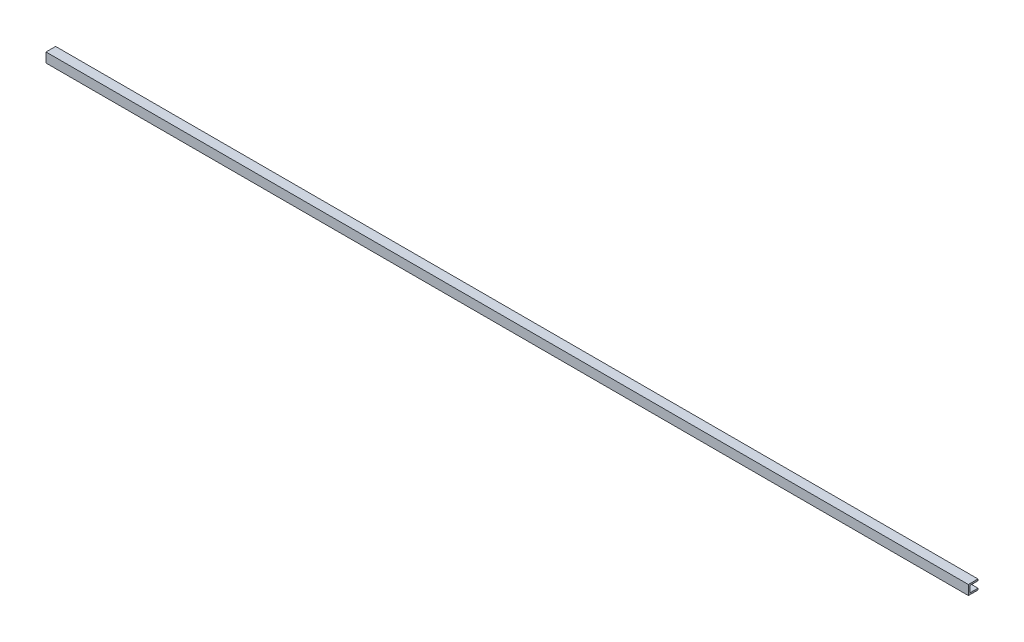
ISO-10303-21;
HEADER;
FILE_DESCRIPTION(('STEP AP214'),'2;1');
FILE_NAME('part.step','',(''),(''),'','','');
FILE_SCHEMA(('AUTOMOTIVE_DESIGN { 1 0 10303 214 1 1 1 1 }'));
ENDSEC;
DATA;
#1=APPLICATION_CONTEXT('core data for automotive mechanical design processes');
#2=APPLICATION_PROTOCOL_DEFINITION('international standard','automotive_design',2000,#1);
#3=PRODUCT_CONTEXT('',#1,'mechanical');
#4=PRODUCT('Part','Part','',(#3));
#5=PRODUCT_RELATED_PRODUCT_CATEGORY('part','',(#4));
#6=PRODUCT_DEFINITION_FORMATION('','',#4);
#7=PRODUCT_DEFINITION_CONTEXT('part definition',#1,'design');
#8=PRODUCT_DEFINITION('design','',#6,#7);
#9=PRODUCT_DEFINITION_SHAPE('','',#8);
#10=(LENGTH_UNIT() NAMED_UNIT(*) SI_UNIT(.MILLI.,.METRE.));
#11=(NAMED_UNIT(*) PLANE_ANGLE_UNIT() SI_UNIT($,.RADIAN.));
#12=(NAMED_UNIT(*) SI_UNIT($,.STERADIAN.) SOLID_ANGLE_UNIT());
#13=UNCERTAINTY_MEASURE_WITH_UNIT(LENGTH_MEASURE(1.E-05),#10,'distance_accuracy_value','');
#14=(GEOMETRIC_REPRESENTATION_CONTEXT(3) GLOBAL_UNCERTAINTY_ASSIGNED_CONTEXT((#13)) GLOBAL_UNIT_ASSIGNED_CONTEXT((#10,
#11,#12)) REPRESENTATION_CONTEXT('',''));
#15=CARTESIAN_POINT('',(0.,0.,0.));
#16=DIRECTION('',(0.,0.,1.));
#17=DIRECTION('',(1.,0.,0.));
#18=AXIS2_PLACEMENT_3D('',#15,#16,#17);
#19=CARTESIAN_POINT('',(-914.4,-9.525,0.));
#20=DIRECTION('',(0.,-1.,0.));
#21=DIRECTION('',(0.,0.,-1.));
#22=AXIS2_PLACEMENT_3D('',#19,#20,#21);
#23=PLANE('',#22);
#24=DIRECTION('',(1.,0.,0.));
#25=VECTOR('',#24,1.);
#26=CARTESIAN_POINT('',(-914.4,-9.525,0.));
#27=LINE('',#26,#25);
#28=CARTESIAN_POINT('',(-914.4,-9.525,0.));
#29=VERTEX_POINT('',#28);
#30=CARTESIAN_POINT('',(914.4,-9.525,0.));
#31=VERTEX_POINT('',#30);
#32=EDGE_CURVE('E83',#29,#31,#27,.T.);
#33=ORIENTED_EDGE('',*,*,#32,.F.);
#34=DIRECTION('',(0.,0.,-1.));
#35=VECTOR('',#34,1.);
#36=CARTESIAN_POINT('',(-914.4,-9.525,0.));
#37=LINE('',#36,#35);
#38=CARTESIAN_POINT('',(-914.4,-9.525,-19.05));
#39=VERTEX_POINT('',#38);
#40=EDGE_CURVE('E122',#29,#39,#37,.T.);
#41=ORIENTED_EDGE('',*,*,#40,.T.);
#42=DIRECTION('',(-1.,0.,0.));
#43=VECTOR('',#42,1.);
#44=CARTESIAN_POINT('',(-914.4,-9.525,-19.05));
#45=LINE('',#44,#43);
#46=CARTESIAN_POINT('',(914.4,-9.525,-19.05));
#47=VERTEX_POINT('',#46);
#48=EDGE_CURVE('E19',#47,#39,#45,.T.);
#49=ORIENTED_EDGE('',*,*,#48,.F.);
#50=DIRECTION('',(0.,0.,-1.));
#51=VECTOR('',#50,1.);
#52=CARTESIAN_POINT('',(914.4,-9.525,0.));
#53=LINE('',#52,#51);
#54=EDGE_CURVE('E94',#31,#47,#53,.T.);
#55=ORIENTED_EDGE('',*,*,#54,.F.);
#56=EDGE_LOOP('',(#33,#41,#49,#55));
#57=FACE_BOUND('',#56,.T.);
#58=ADVANCED_FACE('F16',(#57),#23,.T.);
#59=CARTESIAN_POINT('',(-914.4,-9.525,-19.05));
#60=DIRECTION('',(0.,0.,-1.));
#61=DIRECTION('',(-1.,0.,0.));
#62=AXIS2_PLACEMENT_3D('',#59,#60,#61);
#63=PLANE('',#62);
#64=ORIENTED_EDGE('',*,*,#48,.T.);
#65=DIRECTION('',(0.,1.,0.));
#66=VECTOR('',#65,1.);
#67=CARTESIAN_POINT('',(-914.4,0.,-19.05));
#68=LINE('',#67,#66);
#69=CARTESIAN_POINT('',(-914.4,-6.35,-19.05));
#70=VERTEX_POINT('',#69);
#71=EDGE_CURVE('E118',#39,#70,#68,.T.);
#72=ORIENTED_EDGE('',*,*,#71,.T.);
#73=DIRECTION('',(1.,0.,0.));
#74=VECTOR('',#73,1.);
#75=CARTESIAN_POINT('',(-914.4,-6.35,-19.05));
#76=LINE('',#75,#74);
#77=CARTESIAN_POINT('',(914.4,-6.35,-19.05));
#78=VERTEX_POINT('',#77);
#79=EDGE_CURVE('E110',#78,#70,#76,.F.);
#80=ORIENTED_EDGE('',*,*,#79,.F.);
#81=DIRECTION('',(0.,1.,0.));
#82=VECTOR('',#81,1.);
#83=CARTESIAN_POINT('',(914.4,0.,-19.05));
#84=LINE('',#83,#82);
#85=EDGE_CURVE('E97',#47,#78,#84,.T.);
#86=ORIENTED_EDGE('',*,*,#85,.F.);
#87=EDGE_LOOP('',(#64,#72,#80,#86));
#88=FACE_BOUND('',#87,.T.);
#89=ADVANCED_FACE('F117',(#88),#63,.T.);
#90=CARTESIAN_POINT('',(-914.4,-6.35,-19.05));
#91=DIRECTION('',(0.,1.,0.));
#92=DIRECTION('',(0.,0.,1.));
#93=AXIS2_PLACEMENT_3D('',#90,#91,#92);
#94=PLANE('',#93);
#95=ORIENTED_EDGE('',*,*,#79,.T.);
#96=DIRECTION('',(0.,0.,-1.));
#97=VECTOR('',#96,1.);
#98=CARTESIAN_POINT('',(-914.4,-6.35,0.));
#99=LINE('',#98,#97);
#100=CARTESIAN_POINT('',(-914.4,-6.35,-3.175));
#101=VERTEX_POINT('',#100);
#102=EDGE_CURVE('E124',#70,#101,#99,.F.);
#103=ORIENTED_EDGE('',*,*,#102,.T.);
#104=DIRECTION('',(-1.,0.,0.));
#105=VECTOR('',#104,1.);
#106=CARTESIAN_POINT('',(-914.4,-6.35,-3.175));
#107=LINE('',#106,#105);
#108=CARTESIAN_POINT('',(914.4,-6.35,-3.175));
#109=VERTEX_POINT('',#108);
#110=EDGE_CURVE('E108',#109,#101,#107,.T.);
#111=ORIENTED_EDGE('',*,*,#110,.F.);
#112=DIRECTION('',(0.,0.,-1.));
#113=VECTOR('',#112,1.);
#114=CARTESIAN_POINT('',(914.4,-6.35,0.));
#115=LINE('',#114,#113);
#116=EDGE_CURVE('E142',#78,#109,#115,.F.);
#117=ORIENTED_EDGE('',*,*,#116,.F.);
#118=EDGE_LOOP('',(#95,#103,#111,#117));
#119=FACE_BOUND('',#118,.T.);
#120=ADVANCED_FACE('F145',(#119),#94,.T.);
#121=CARTESIAN_POINT('',(-914.4,-6.35,-3.175));
#122=DIRECTION('',(0.,0.,-1.));
#123=DIRECTION('',(-1.,0.,0.));
#124=AXIS2_PLACEMENT_3D('',#121,#122,#123);
#125=PLANE('',#124);
#126=ORIENTED_EDGE('',*,*,#110,.T.);
#127=DIRECTION('',(0.,1.,0.));
#128=VECTOR('',#127,1.);
#129=CARTESIAN_POINT('',(-914.4,0.,-3.175));
#130=LINE('',#129,#128);
#131=CARTESIAN_POINT('',(-914.4,6.35,-3.175));
#132=VERTEX_POINT('',#131);
#133=EDGE_CURVE('E126',#101,#132,#130,.T.);
#134=ORIENTED_EDGE('',*,*,#133,.T.);
#135=DIRECTION('',(1.,0.,0.));
#136=VECTOR('',#135,1.);
#137=CARTESIAN_POINT('',(-914.4,6.35,-3.175));
#138=LINE('',#137,#136);
#139=CARTESIAN_POINT('',(914.4,6.35,-3.175));
#140=VERTEX_POINT('',#139);
#141=EDGE_CURVE('E91',#140,#132,#138,.F.);
#142=ORIENTED_EDGE('',*,*,#141,.F.);
#143=DIRECTION('',(0.,1.,0.));
#144=VECTOR('',#143,1.);
#145=CARTESIAN_POINT('',(914.4,0.,-3.175));
#146=LINE('',#145,#144);
#147=EDGE_CURVE('E139',#109,#140,#146,.T.);
#148=ORIENTED_EDGE('',*,*,#147,.F.);
#149=EDGE_LOOP('',(#126,#134,#142,#148));
#150=FACE_BOUND('',#149,.T.);
#151=ADVANCED_FACE('F147',(#150),#125,.T.);
#152=CARTESIAN_POINT('',(-914.4,6.35,-3.175));
#153=DIRECTION('',(0.,-1.,0.));
#154=DIRECTION('',(0.,0.,-1.));
#155=AXIS2_PLACEMENT_3D('',#152,#153,#154);
#156=PLANE('',#155);
#157=ORIENTED_EDGE('',*,*,#141,.T.);
#158=DIRECTION('',(0.,0.,-1.));
#159=VECTOR('',#158,1.);
#160=CARTESIAN_POINT('',(-914.4,6.35,0.));
#161=LINE('',#160,#159);
#162=CARTESIAN_POINT('',(-914.4,6.35,-19.05));
#163=VERTEX_POINT('',#162);
#164=EDGE_CURVE('E162',#132,#163,#161,.T.);
#165=ORIENTED_EDGE('',*,*,#164,.T.);
#166=DIRECTION('',(-1.,0.,0.));
#167=VECTOR('',#166,1.);
#168=CARTESIAN_POINT('',(-914.4,6.35,-19.05));
#169=LINE('',#168,#167);
#170=CARTESIAN_POINT('',(914.4,6.35,-19.05));
#171=VERTEX_POINT('',#170);
#172=EDGE_CURVE('E132',#171,#163,#169,.T.);
#173=ORIENTED_EDGE('',*,*,#172,.F.);
#174=DIRECTION('',(0.,0.,-1.));
#175=VECTOR('',#174,1.);
#176=CARTESIAN_POINT('',(914.4,6.35,0.));
#177=LINE('',#176,#175);
#178=EDGE_CURVE('E137',#140,#171,#177,.T.);
#179=ORIENTED_EDGE('',*,*,#178,.F.);
#180=EDGE_LOOP('',(#157,#165,#173,#179));
#181=FACE_BOUND('',#180,.T.);
#182=ADVANCED_FACE('F151',(#181),#156,.T.);
#183=CARTESIAN_POINT('',(-914.4,9.525,0.));
#184=DIRECTION('',(0.,0.,1.));
#185=DIRECTION('',(1.,0.,0.));
#186=AXIS2_PLACEMENT_3D('',#183,#184,#185);
#187=PLANE('',#186);
#188=DIRECTION('',(1.,0.,0.));
#189=VECTOR('',#188,1.);
#190=CARTESIAN_POINT('',(-914.4,9.525,0.));
#191=LINE('',#190,#189);
#192=CARTESIAN_POINT('',(-914.4,9.525,0.));
#193=VERTEX_POINT('',#192);
#194=CARTESIAN_POINT('',(914.4,9.525,0.));
#195=VERTEX_POINT('',#194);
#196=EDGE_CURVE('E157',#193,#195,#191,.T.);
#197=ORIENTED_EDGE('',*,*,#196,.F.);
#198=DIRECTION('',(0.,1.,0.));
#199=VECTOR('',#198,1.);
#200=CARTESIAN_POINT('',(-914.4,0.,0.));
#201=LINE('',#200,#199);
#202=EDGE_CURVE('E89',#193,#29,#201,.F.);
#203=ORIENTED_EDGE('',*,*,#202,.T.);
#204=ORIENTED_EDGE('',*,*,#32,.T.);
#205=DIRECTION('',(0.,1.,0.));
#206=VECTOR('',#205,1.);
#207=CARTESIAN_POINT('',(914.4,0.,0.));
#208=LINE('',#207,#206);
#209=EDGE_CURVE('E86',#195,#31,#208,.F.);
#210=ORIENTED_EDGE('',*,*,#209,.F.);
#211=EDGE_LOOP('',(#197,#203,#204,#210));
#212=FACE_BOUND('',#211,.T.);
#213=ADVANCED_FACE('F84',(#212),#187,.T.);
#214=CARTESIAN_POINT('',(914.4,0.,0.));
#215=DIRECTION('',(1.,0.,0.));
#216=DIRECTION('',(0.,0.,-1.));
#217=AXIS2_PLACEMENT_3D('',#214,#215,#216);
#218=PLANE('',#217);
#219=DIRECTION('',(0.,1.,0.));
#220=VECTOR('',#219,1.);
#221=CARTESIAN_POINT('',(914.4,6.35,-19.05));
#222=LINE('',#221,#220);
#223=CARTESIAN_POINT('',(914.4,9.525,-19.05));
#224=VERTEX_POINT('',#223);
#225=EDGE_CURVE('E134',#224,#171,#222,.F.);
#226=ORIENTED_EDGE('',*,*,#225,.F.);
#227=DIRECTION('',(0.,0.,1.));
#228=VECTOR('',#227,1.);
#229=CARTESIAN_POINT('',(914.4,9.525,-19.05));
#230=LINE('',#229,#228);
#231=EDGE_CURVE('E101',#195,#224,#230,.F.);
#232=ORIENTED_EDGE('',*,*,#231,.F.);
#233=ORIENTED_EDGE('',*,*,#209,.T.);
#234=ORIENTED_EDGE('',*,*,#54,.T.);
#235=ORIENTED_EDGE('',*,*,#85,.T.);
#236=ORIENTED_EDGE('',*,*,#116,.T.);
#237=ORIENTED_EDGE('',*,*,#147,.T.);
#238=ORIENTED_EDGE('',*,*,#178,.T.);
#239=EDGE_LOOP('',(#226,#232,#233,#234,#235,#236,#237,#238));
#240=FACE_BOUND('',#239,.T.);
#241=ADVANCED_FACE('F99',(#240),#218,.T.);
#242=CARTESIAN_POINT('',(-914.4,6.35,-19.05));
#243=DIRECTION('',(0.,0.,-1.));
#244=DIRECTION('',(-1.,0.,0.));
#245=AXIS2_PLACEMENT_3D('',#242,#243,#244);
#246=PLANE('',#245);
#247=ORIENTED_EDGE('',*,*,#172,.T.);
#248=DIRECTION('',(0.,1.,0.));
#249=VECTOR('',#248,1.);
#250=CARTESIAN_POINT('',(-914.4,0.,-19.05));
#251=LINE('',#250,#249);
#252=CARTESIAN_POINT('',(-914.4,9.525,-19.05));
#253=VERTEX_POINT('',#252);
#254=EDGE_CURVE('E34',#163,#253,#251,.T.);
#255=ORIENTED_EDGE('',*,*,#254,.T.);
#256=DIRECTION('',(1.,0.,0.));
#257=VECTOR('',#256,1.);
#258=CARTESIAN_POINT('',(-914.4,9.525,-19.05));
#259=LINE('',#258,#257);
#260=EDGE_CURVE('E25',#224,#253,#259,.F.);
#261=ORIENTED_EDGE('',*,*,#260,.F.);
#262=ORIENTED_EDGE('',*,*,#225,.T.);
#263=EDGE_LOOP('',(#247,#255,#261,#262));
#264=FACE_BOUND('',#263,.T.);
#265=ADVANCED_FACE('F153',(#264),#246,.T.);
#266=CARTESIAN_POINT('',(-914.4,0.,0.));
#267=DIRECTION('',(1.,0.,0.));
#268=DIRECTION('',(0.,0.,-1.));
#269=AXIS2_PLACEMENT_3D('',#266,#267,#268);
#270=PLANE('',#269);
#271=ORIENTED_EDGE('',*,*,#164,.F.);
#272=ORIENTED_EDGE('',*,*,#133,.F.);
#273=ORIENTED_EDGE('',*,*,#102,.F.);
#274=ORIENTED_EDGE('',*,*,#71,.F.);
#275=ORIENTED_EDGE('',*,*,#40,.F.);
#276=ORIENTED_EDGE('',*,*,#202,.F.);
#277=DIRECTION('',(0.,0.,1.));
#278=VECTOR('',#277,1.);
#279=CARTESIAN_POINT('',(-914.4,9.525,-19.05));
#280=LINE('',#279,#278);
#281=EDGE_CURVE('E11',#253,#193,#280,.T.);
#282=ORIENTED_EDGE('',*,*,#281,.F.);
#283=ORIENTED_EDGE('',*,*,#254,.F.);
#284=EDGE_LOOP('',(#271,#272,#273,#274,#275,#276,#282,#283));
#285=FACE_BOUND('',#284,.T.);
#286=ADVANCED_FACE('F121',(#285),#270,.F.);
#287=CARTESIAN_POINT('',(-914.4,9.525,-19.05));
#288=DIRECTION('',(0.,1.,0.));
#289=DIRECTION('',(0.,0.,1.));
#290=AXIS2_PLACEMENT_3D('',#287,#288,#289);
#291=PLANE('',#290);
#292=ORIENTED_EDGE('',*,*,#260,.T.);
#293=ORIENTED_EDGE('',*,*,#281,.T.);
#294=ORIENTED_EDGE('',*,*,#196,.T.);
#295=ORIENTED_EDGE('',*,*,#231,.T.);
#296=EDGE_LOOP('',(#292,#293,#294,#295));
#297=FACE_BOUND('',#296,.T.);
#298=ADVANCED_FACE('F156',(#297),#291,.T.);
#299=CLOSED_SHELL('',(#58,#89,#120,#151,#182,#213,#241,#265,#286,#298));
#300=MANIFOLD_SOLID_BREP('B1',#299);
#301=ADVANCED_BREP_SHAPE_REPRESENTATION('',(#18,#300),#14);
#302=SHAPE_DEFINITION_REPRESENTATION(#9,#301);
ENDSEC;
END-ISO-10303-21;
